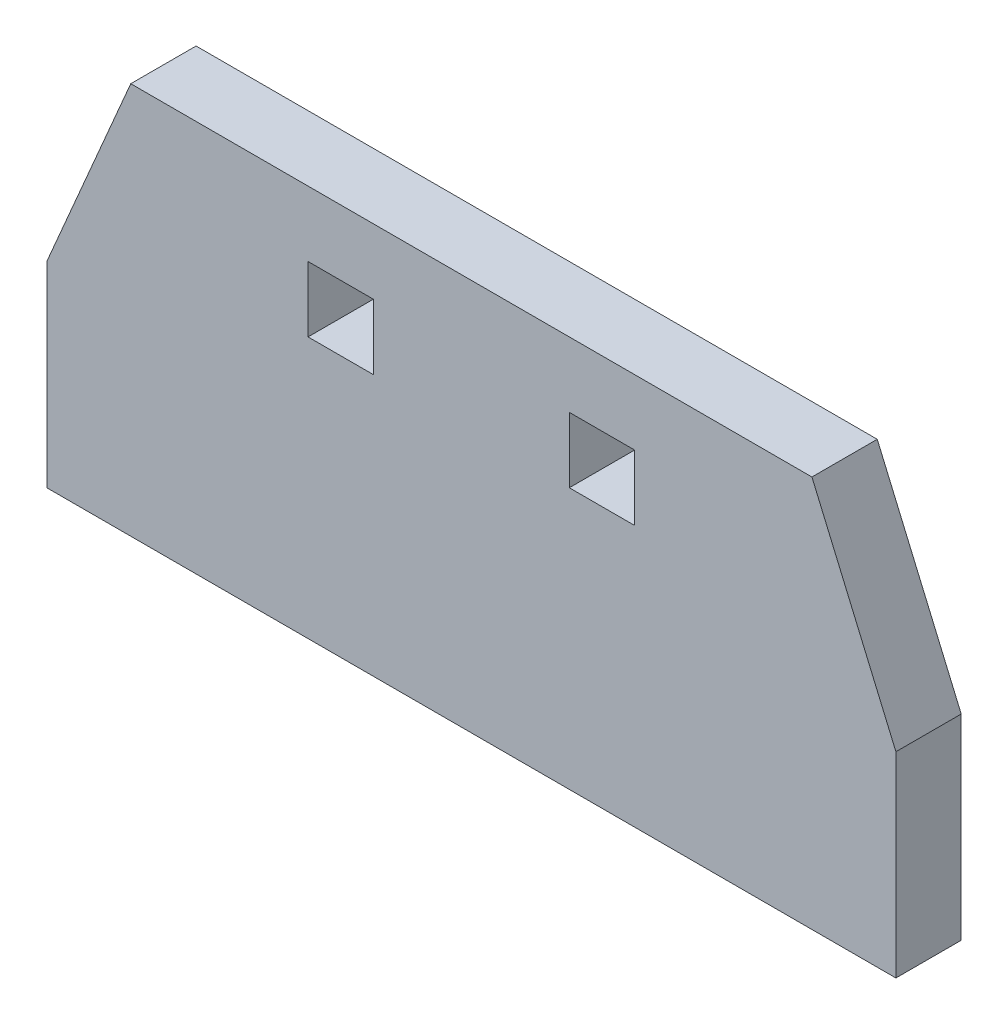
ISO-10303-21;
HEADER;
FILE_DESCRIPTION(('STEP AP214'),'2;1');
FILE_NAME('part.step','',(''),(''),'','','');
FILE_SCHEMA(('AUTOMOTIVE_DESIGN { 1 0 10303 214 1 1 1 1 }'));
ENDSEC;
DATA;
#1=APPLICATION_CONTEXT('core data for automotive mechanical design processes');
#2=APPLICATION_PROTOCOL_DEFINITION('international standard','automotive_design',2000,#1);
#3=PRODUCT_CONTEXT('',#1,'mechanical');
#4=PRODUCT('Part','Part','',(#3));
#5=PRODUCT_RELATED_PRODUCT_CATEGORY('part','',(#4));
#6=PRODUCT_DEFINITION_FORMATION('','',#4);
#7=PRODUCT_DEFINITION_CONTEXT('part definition',#1,'design');
#8=PRODUCT_DEFINITION('design','',#6,#7);
#9=PRODUCT_DEFINITION_SHAPE('','',#8);
#10=(LENGTH_UNIT() NAMED_UNIT(*) SI_UNIT(.MILLI.,.METRE.));
#11=(NAMED_UNIT(*) PLANE_ANGLE_UNIT() SI_UNIT($,.RADIAN.));
#12=(NAMED_UNIT(*) SI_UNIT($,.STERADIAN.) SOLID_ANGLE_UNIT());
#13=UNCERTAINTY_MEASURE_WITH_UNIT(LENGTH_MEASURE(1.E-05),#10,'distance_accuracy_value','');
#14=(GEOMETRIC_REPRESENTATION_CONTEXT(3) GLOBAL_UNCERTAINTY_ASSIGNED_CONTEXT((#13)) GLOBAL_UNIT_ASSIGNED_CONTEXT((#10,
#11,#12)) REPRESENTATION_CONTEXT('',''));
#15=CARTESIAN_POINT('',(0.,0.,0.));
#16=DIRECTION('',(0.,0.,1.));
#17=DIRECTION('',(1.,0.,0.));
#18=AXIS2_PLACEMENT_3D('',#15,#16,#17);
#19=CARTESIAN_POINT('',(0.,0.,0.));
#20=DIRECTION('',(0.,0.,-1.));
#21=DIRECTION('',(-1.,0.,0.));
#22=AXIS2_PLACEMENT_3D('',#19,#20,#21);
#23=PLANE('',#22);
#24=DIRECTION('',(0.,-1.,0.));
#25=VECTOR('',#24,1.);
#26=CARTESIAN_POINT('',(25.,35.,0.));
#27=LINE('',#26,#25);
#28=CARTESIAN_POINT('',(25.,35.,0.));
#29=VERTEX_POINT('',#28);
#30=CARTESIAN_POINT('',(25.,30.,0.));
#31=VERTEX_POINT('',#30);
#32=EDGE_CURVE('E208',#29,#31,#27,.T.);
#33=ORIENTED_EDGE('',*,*,#32,.F.);
#34=DIRECTION('',(1.,0.,0.));
#35=VECTOR('',#34,1.);
#36=CARTESIAN_POINT('',(25.,35.,0.));
#37=LINE('',#36,#35);
#38=CARTESIAN_POINT('',(20.,35.,0.));
#39=VERTEX_POINT('',#38);
#40=EDGE_CURVE('E218',#39,#29,#37,.T.);
#41=ORIENTED_EDGE('',*,*,#40,.F.);
#42=DIRECTION('',(0.,1.,0.));
#43=VECTOR('',#42,1.);
#44=CARTESIAN_POINT('',(20.,35.,0.));
#45=LINE('',#44,#43);
#46=CARTESIAN_POINT('',(20.,30.,0.));
#47=VERTEX_POINT('',#46);
#48=EDGE_CURVE('E232',#47,#39,#45,.T.);
#49=ORIENTED_EDGE('',*,*,#48,.F.);
#50=DIRECTION('',(-1.,0.,0.));
#51=VECTOR('',#50,1.);
#52=CARTESIAN_POINT('',(25.,30.,0.));
#53=LINE('',#52,#51);
#54=EDGE_CURVE('E229',#31,#47,#53,.T.);
#55=ORIENTED_EDGE('',*,*,#54,.F.);
#56=EDGE_LOOP('',(#33,#41,#49,#55));
#57=FACE_BOUND('',#56,.T.);
#58=DIRECTION('',(0.,-1.,0.));
#59=VECTOR('',#58,1.);
#60=CARTESIAN_POINT('',(5.00000000000001,35.,0.));
#61=LINE('',#60,#59);
#62=CARTESIAN_POINT('',(5.00000000000001,35.,0.));
#63=VERTEX_POINT('',#62);
#64=CARTESIAN_POINT('',(5.00000000000001,30.,0.));
#65=VERTEX_POINT('',#64);
#66=EDGE_CURVE('E56',#63,#65,#61,.T.);
#67=ORIENTED_EDGE('',*,*,#66,.F.);
#68=DIRECTION('',(1.,0.,0.));
#69=VECTOR('',#68,1.);
#70=CARTESIAN_POINT('',(5.00000000000001,35.,0.));
#71=LINE('',#70,#69);
#72=CARTESIAN_POINT('',(0.,35.,0.));
#73=VERTEX_POINT('',#72);
#74=EDGE_CURVE('E187',#73,#63,#71,.T.);
#75=ORIENTED_EDGE('',*,*,#74,.F.);
#76=DIRECTION('',(0.,1.,0.));
#77=VECTOR('',#76,1.);
#78=CARTESIAN_POINT('',(0.,35.,0.));
#79=LINE('',#78,#77);
#80=CARTESIAN_POINT('',(0.,30.,0.));
#81=VERTEX_POINT('',#80);
#82=EDGE_CURVE('E201',#81,#73,#79,.T.);
#83=ORIENTED_EDGE('',*,*,#82,.F.);
#84=DIRECTION('',(-1.,0.,0.));
#85=VECTOR('',#84,1.);
#86=CARTESIAN_POINT('',(5.00000000000001,30.,0.));
#87=LINE('',#86,#85);
#88=EDGE_CURVE('E198',#65,#81,#87,.T.);
#89=ORIENTED_EDGE('',*,*,#88,.F.);
#90=EDGE_LOOP('',(#67,#75,#83,#89));
#91=FACE_BOUND('',#90,.T.);
#92=DIRECTION('',(-0.393919298579167,-0.919145030018058,0.));
#93=VECTOR('',#92,1.);
#94=CARTESIAN_POINT('',(-5.00000000000002,60.,0.));
#95=LINE('',#94,#93);
#96=CARTESIAN_POINT('',(-13.5714285714286,40.,0.));
#97=VERTEX_POINT('',#96);
#98=CARTESIAN_POINT('',(-20.,25.,0.));
#99=VERTEX_POINT('',#98);
#100=EDGE_CURVE('E148',#97,#99,#95,.T.);
#101=ORIENTED_EDGE('',*,*,#100,.F.);
#102=DIRECTION('',(1.,0.,0.));
#103=VECTOR('',#102,1.);
#104=CARTESIAN_POINT('',(45.,40.,0.));
#105=LINE('',#104,#103);
#106=CARTESIAN_POINT('',(38.5714285714286,40.,0.));
#107=VERTEX_POINT('',#106);
#108=EDGE_CURVE('E49',#97,#107,#105,.T.);
#109=ORIENTED_EDGE('',*,*,#108,.T.);
#110=DIRECTION('',(-0.393919298579168,0.919145030018058,0.));
#111=VECTOR('',#110,1.);
#112=CARTESIAN_POINT('',(30.,60.,0.));
#113=LINE('',#112,#111);
#114=CARTESIAN_POINT('',(45.,25.,0.));
#115=VERTEX_POINT('',#114);
#116=EDGE_CURVE('E145',#115,#107,#113,.T.);
#117=ORIENTED_EDGE('',*,*,#116,.F.);
#118=DIRECTION('',(0.,1.,0.));
#119=VECTOR('',#118,1.);
#120=CARTESIAN_POINT('',(45.,10.,0.));
#121=LINE('',#120,#119);
#122=CARTESIAN_POINT('',(45.,10.,0.));
#123=VERTEX_POINT('',#122);
#124=EDGE_CURVE('E181',#123,#115,#121,.T.);
#125=ORIENTED_EDGE('',*,*,#124,.F.);
#126=DIRECTION('',(1.,0.,0.));
#127=VECTOR('',#126,1.);
#128=CARTESIAN_POINT('',(37.5,10.,0.));
#129=LINE('',#128,#127);
#130=CARTESIAN_POINT('',(-20.,10.,0.));
#131=VERTEX_POINT('',#130);
#132=EDGE_CURVE('E161',#131,#123,#129,.T.);
#133=ORIENTED_EDGE('',*,*,#132,.F.);
#134=DIRECTION('',(0.,1.,0.));
#135=VECTOR('',#134,1.);
#136=CARTESIAN_POINT('',(-20.,10.,0.));
#137=LINE('',#136,#135);
#138=EDGE_CURVE('E170',#131,#99,#137,.T.);
#139=ORIENTED_EDGE('',*,*,#138,.T.);
#140=EDGE_LOOP('',(#101,#109,#117,#125,#133,#139));
#141=FACE_BOUND('',#140,.T.);
#142=ADVANCED_FACE('F35',(#57,#91,#141),#23,.T.);
#143=CARTESIAN_POINT('',(0.,0.,5.));
#144=DIRECTION('',(0.,0.,1.));
#145=DIRECTION('',(1.,0.,0.));
#146=AXIS2_PLACEMENT_3D('',#143,#144,#145);
#147=PLANE('',#146);
#148=DIRECTION('',(0.,-1.,0.));
#149=VECTOR('',#148,1.);
#150=CARTESIAN_POINT('',(25.,35.,5.));
#151=LINE('',#150,#149);
#152=CARTESIAN_POINT('',(25.,35.,5.));
#153=VERTEX_POINT('',#152);
#154=CARTESIAN_POINT('',(25.,30.,5.));
#155=VERTEX_POINT('',#154);
#156=EDGE_CURVE('E214',#153,#155,#151,.T.);
#157=ORIENTED_EDGE('',*,*,#156,.T.);
#158=DIRECTION('',(-1.,0.,0.));
#159=VECTOR('',#158,1.);
#160=CARTESIAN_POINT('',(25.,30.,5.));
#161=LINE('',#160,#159);
#162=CARTESIAN_POINT('',(20.,30.,5.));
#163=VERTEX_POINT('',#162);
#164=EDGE_CURVE('E217',#155,#163,#161,.T.);
#165=ORIENTED_EDGE('',*,*,#164,.T.);
#166=DIRECTION('',(0.,1.,0.));
#167=VECTOR('',#166,1.);
#168=CARTESIAN_POINT('',(20.,35.,5.));
#169=LINE('',#168,#167);
#170=CARTESIAN_POINT('',(20.,35.,5.));
#171=VERTEX_POINT('',#170);
#172=EDGE_CURVE('E221',#163,#171,#169,.T.);
#173=ORIENTED_EDGE('',*,*,#172,.T.);
#174=DIRECTION('',(1.,0.,0.));
#175=VECTOR('',#174,1.);
#176=CARTESIAN_POINT('',(25.,35.,5.));
#177=LINE('',#176,#175);
#178=EDGE_CURVE('E224',#171,#153,#177,.T.);
#179=ORIENTED_EDGE('',*,*,#178,.T.);
#180=EDGE_LOOP('',(#157,#165,#173,#179));
#181=FACE_BOUND('',#180,.T.);
#182=DIRECTION('',(0.,-1.,0.));
#183=VECTOR('',#182,1.);
#184=CARTESIAN_POINT('',(5.00000000000001,35.,5.));
#185=LINE('',#184,#183);
#186=CARTESIAN_POINT('',(5.00000000000001,35.,5.));
#187=VERTEX_POINT('',#186);
#188=CARTESIAN_POINT('',(5.00000000000001,30.,5.));
#189=VERTEX_POINT('',#188);
#190=EDGE_CURVE('E183',#187,#189,#185,.T.);
#191=ORIENTED_EDGE('',*,*,#190,.T.);
#192=DIRECTION('',(-1.,0.,0.));
#193=VECTOR('',#192,1.);
#194=CARTESIAN_POINT('',(5.00000000000001,30.,5.));
#195=LINE('',#194,#193);
#196=CARTESIAN_POINT('',(0.,30.,5.));
#197=VERTEX_POINT('',#196);
#198=EDGE_CURVE('E186',#189,#197,#195,.T.);
#199=ORIENTED_EDGE('',*,*,#198,.T.);
#200=DIRECTION('',(0.,1.,0.));
#201=VECTOR('',#200,1.);
#202=CARTESIAN_POINT('',(0.,35.,5.));
#203=LINE('',#202,#201);
#204=CARTESIAN_POINT('',(0.,35.,5.));
#205=VERTEX_POINT('',#204);
#206=EDGE_CURVE('E190',#197,#205,#203,.T.);
#207=ORIENTED_EDGE('',*,*,#206,.T.);
#208=DIRECTION('',(1.,0.,0.));
#209=VECTOR('',#208,1.);
#210=CARTESIAN_POINT('',(5.00000000000001,35.,5.));
#211=LINE('',#210,#209);
#212=EDGE_CURVE('E193',#205,#187,#211,.T.);
#213=ORIENTED_EDGE('',*,*,#212,.T.);
#214=EDGE_LOOP('',(#191,#199,#207,#213));
#215=FACE_BOUND('',#214,.T.);
#216=DIRECTION('',(-0.393919298579168,0.919145030018058,0.));
#217=VECTOR('',#216,1.);
#218=CARTESIAN_POINT('',(30.,60.,5.));
#219=LINE('',#218,#217);
#220=CARTESIAN_POINT('',(45.,25.,5.00000000000001));
#221=VERTEX_POINT('',#220);
#222=CARTESIAN_POINT('',(38.5714285714286,40.,5.00000000000001));
#223=VERTEX_POINT('',#222);
#224=EDGE_CURVE('E153',#221,#223,#219,.T.);
#225=ORIENTED_EDGE('',*,*,#224,.T.);
#226=DIRECTION('',(-1.,0.,0.));
#227=VECTOR('',#226,1.);
#228=CARTESIAN_POINT('',(-20.,40.,5.));
#229=LINE('',#228,#227);
#230=CARTESIAN_POINT('',(-13.5714285714286,40.,5.));
#231=VERTEX_POINT('',#230);
#232=EDGE_CURVE('E135',#223,#231,#229,.T.);
#233=ORIENTED_EDGE('',*,*,#232,.T.);
#234=DIRECTION('',(-0.393919298579167,-0.919145030018058,0.));
#235=VECTOR('',#234,1.);
#236=CARTESIAN_POINT('',(-5.00000000000002,60.,5.));
#237=LINE('',#236,#235);
#238=CARTESIAN_POINT('',(-20.,25.,5.));
#239=VERTEX_POINT('',#238);
#240=EDGE_CURVE('E139',#231,#239,#237,.T.);
#241=ORIENTED_EDGE('',*,*,#240,.T.);
#242=DIRECTION('',(0.,1.,0.));
#243=VECTOR('',#242,1.);
#244=CARTESIAN_POINT('',(-20.,10.,5.));
#245=LINE('',#244,#243);
#246=CARTESIAN_POINT('',(-20.,10.,5.));
#247=VERTEX_POINT('',#246);
#248=EDGE_CURVE('E175',#247,#239,#245,.T.);
#249=ORIENTED_EDGE('',*,*,#248,.F.);
#250=DIRECTION('',(-1.,0.,0.));
#251=VECTOR('',#250,1.);
#252=CARTESIAN_POINT('',(37.5,10.,5.));
#253=LINE('',#252,#251);
#254=CARTESIAN_POINT('',(45.,10.,5.00000000000001));
#255=VERTEX_POINT('',#254);
#256=EDGE_CURVE('E166',#255,#247,#253,.T.);
#257=ORIENTED_EDGE('',*,*,#256,.F.);
#258=DIRECTION('',(0.,1.,0.));
#259=VECTOR('',#258,1.);
#260=CARTESIAN_POINT('',(45.,10.,5.00000000000001));
#261=LINE('',#260,#259);
#262=EDGE_CURVE('E178',#255,#221,#261,.T.);
#263=ORIENTED_EDGE('',*,*,#262,.T.);
#264=EDGE_LOOP('',(#225,#233,#241,#249,#257,#263));
#265=FACE_BOUND('',#264,.T.);
#266=ADVANCED_FACE('F258',(#181,#215,#265),#147,.T.);
#267=CARTESIAN_POINT('',(30.,60.,0.));
#268=DIRECTION('',(0.919145030018058,0.393919298579168,0.));
#269=DIRECTION('',(-0.393919298579168,0.919145030018058,0.));
#270=AXIS2_PLACEMENT_3D('',#267,#268,#269);
#271=PLANE('',#270);
#272=ORIENTED_EDGE('',*,*,#116,.T.);
#273=DIRECTION('',(0.,0.,1.));
#274=VECTOR('',#273,1.);
#275=CARTESIAN_POINT('',(38.5714285714286,40.,0.));
#276=LINE('',#275,#274);
#277=EDGE_CURVE('E132',#107,#223,#276,.T.);
#278=ORIENTED_EDGE('',*,*,#277,.T.);
#279=ORIENTED_EDGE('',*,*,#224,.F.);
#280=DIRECTION('',(0.,0.,1.));
#281=VECTOR('',#280,1.);
#282=CARTESIAN_POINT('',(45.,25.,5.00000000000001));
#283=LINE('',#282,#281);
#284=EDGE_CURVE('E152',#115,#221,#283,.T.);
#285=ORIENTED_EDGE('',*,*,#284,.F.);
#286=EDGE_LOOP('',(#272,#278,#279,#285));
#287=FACE_BOUND('',#286,.T.);
#288=ADVANCED_FACE('F150',(#287),#271,.T.);
#289=CARTESIAN_POINT('',(-5.00000000000002,60.,0.));
#290=DIRECTION('',(-0.919145030018058,0.393919298579167,0.));
#291=DIRECTION('',(-0.393919298579167,-0.919145030018058,0.));
#292=AXIS2_PLACEMENT_3D('',#289,#290,#291);
#293=PLANE('',#292);
#294=ORIENTED_EDGE('',*,*,#240,.F.);
#295=DIRECTION('',(0.,0.,-1.));
#296=VECTOR('',#295,1.);
#297=CARTESIAN_POINT('',(-13.5714285714286,40.,0.));
#298=LINE('',#297,#296);
#299=EDGE_CURVE('E12',#231,#97,#298,.T.);
#300=ORIENTED_EDGE('',*,*,#299,.T.);
#301=ORIENTED_EDGE('',*,*,#100,.T.);
#302=DIRECTION('',(0.,0.,-1.));
#303=VECTOR('',#302,1.);
#304=CARTESIAN_POINT('',(-20.,25.,5.));
#305=LINE('',#304,#303);
#306=EDGE_CURVE('E155',#239,#99,#305,.T.);
#307=ORIENTED_EDGE('',*,*,#306,.F.);
#308=EDGE_LOOP('',(#294,#300,#301,#307));
#309=FACE_BOUND('',#308,.T.);
#310=ADVANCED_FACE('F270',(#309),#293,.T.);
#311=CARTESIAN_POINT('',(25.,35.,5.));
#312=DIRECTION('',(1.,0.,0.));
#313=DIRECTION('',(0.,0.,-1.));
#314=AXIS2_PLACEMENT_3D('',#311,#312,#313);
#315=PLANE('',#314);
#316=ORIENTED_EDGE('',*,*,#32,.T.);
#317=DIRECTION('',(0.,0.,-1.));
#318=VECTOR('',#317,1.);
#319=CARTESIAN_POINT('',(25.,30.,5.));
#320=LINE('',#319,#318);
#321=EDGE_CURVE('E227',#155,#31,#320,.T.);
#322=ORIENTED_EDGE('',*,*,#321,.F.);
#323=ORIENTED_EDGE('',*,*,#156,.F.);
#324=DIRECTION('',(0.,0.,-1.));
#325=VECTOR('',#324,1.);
#326=CARTESIAN_POINT('',(25.,35.,5.));
#327=LINE('',#326,#325);
#328=EDGE_CURVE('E42',#153,#29,#327,.T.);
#329=ORIENTED_EDGE('',*,*,#328,.T.);
#330=EDGE_LOOP('',(#316,#322,#323,#329));
#331=FACE_BOUND('',#330,.T.);
#332=ADVANCED_FACE('F260',(#331),#315,.F.);
#333=CARTESIAN_POINT('',(25.,35.,5.));
#334=DIRECTION('',(0.,1.,0.));
#335=DIRECTION('',(0.,0.,1.));
#336=AXIS2_PLACEMENT_3D('',#333,#334,#335);
#337=PLANE('',#336);
#338=ORIENTED_EDGE('',*,*,#40,.T.);
#339=ORIENTED_EDGE('',*,*,#328,.F.);
#340=ORIENTED_EDGE('',*,*,#178,.F.);
#341=DIRECTION('',(0.,0.,-1.));
#342=VECTOR('',#341,1.);
#343=CARTESIAN_POINT('',(20.,35.,5.));
#344=LINE('',#343,#342);
#345=EDGE_CURVE('E238',#171,#39,#344,.T.);
#346=ORIENTED_EDGE('',*,*,#345,.T.);
#347=EDGE_LOOP('',(#338,#339,#340,#346));
#348=FACE_BOUND('',#347,.T.);
#349=ADVANCED_FACE('F262',(#348),#337,.F.);
#350=CARTESIAN_POINT('',(20.,35.,5.));
#351=DIRECTION('',(-1.,0.,0.));
#352=DIRECTION('',(0.,0.,1.));
#353=AXIS2_PLACEMENT_3D('',#350,#351,#352);
#354=PLANE('',#353);
#355=ORIENTED_EDGE('',*,*,#48,.T.);
#356=ORIENTED_EDGE('',*,*,#345,.F.);
#357=ORIENTED_EDGE('',*,*,#172,.F.);
#358=DIRECTION('',(0.,0.,-1.));
#359=VECTOR('',#358,1.);
#360=CARTESIAN_POINT('',(20.,30.,5.));
#361=LINE('',#360,#359);
#362=EDGE_CURVE('E240',#163,#47,#361,.T.);
#363=ORIENTED_EDGE('',*,*,#362,.T.);
#364=EDGE_LOOP('',(#355,#356,#357,#363));
#365=FACE_BOUND('',#364,.T.);
#366=ADVANCED_FACE('F255',(#365),#354,.F.);
#367=CARTESIAN_POINT('',(25.,30.,5.));
#368=DIRECTION('',(0.,-1.,0.));
#369=DIRECTION('',(0.,0.,-1.));
#370=AXIS2_PLACEMENT_3D('',#367,#368,#369);
#371=PLANE('',#370);
#372=ORIENTED_EDGE('',*,*,#54,.T.);
#373=ORIENTED_EDGE('',*,*,#362,.F.);
#374=ORIENTED_EDGE('',*,*,#164,.F.);
#375=ORIENTED_EDGE('',*,*,#321,.T.);
#376=EDGE_LOOP('',(#372,#373,#374,#375));
#377=FACE_BOUND('',#376,.T.);
#378=ADVANCED_FACE('F245',(#377),#371,.F.);
#379=CARTESIAN_POINT('',(5.00000000000001,35.,5.));
#380=DIRECTION('',(1.,0.,0.));
#381=DIRECTION('',(0.,0.,-1.));
#382=AXIS2_PLACEMENT_3D('',#379,#380,#381);
#383=PLANE('',#382);
#384=ORIENTED_EDGE('',*,*,#66,.T.);
#385=DIRECTION('',(0.,0.,-1.));
#386=VECTOR('',#385,1.);
#387=CARTESIAN_POINT('',(5.00000000000001,30.,5.));
#388=LINE('',#387,#386);
#389=EDGE_CURVE('E196',#189,#65,#388,.T.);
#390=ORIENTED_EDGE('',*,*,#389,.F.);
#391=ORIENTED_EDGE('',*,*,#190,.F.);
#392=DIRECTION('',(0.,0.,-1.));
#393=VECTOR('',#392,1.);
#394=CARTESIAN_POINT('',(5.00000000000001,35.,5.));
#395=LINE('',#394,#393);
#396=EDGE_CURVE('E206',#187,#63,#395,.T.);
#397=ORIENTED_EDGE('',*,*,#396,.T.);
#398=EDGE_LOOP('',(#384,#390,#391,#397));
#399=FACE_BOUND('',#398,.T.);
#400=ADVANCED_FACE('F284',(#399),#383,.F.);
#401=CARTESIAN_POINT('',(5.00000000000001,35.,5.));
#402=DIRECTION('',(0.,1.,0.));
#403=DIRECTION('',(0.,0.,1.));
#404=AXIS2_PLACEMENT_3D('',#401,#402,#403);
#405=PLANE('',#404);
#406=ORIENTED_EDGE('',*,*,#74,.T.);
#407=ORIENTED_EDGE('',*,*,#396,.F.);
#408=ORIENTED_EDGE('',*,*,#212,.F.);
#409=DIRECTION('',(0.,0.,-1.));
#410=VECTOR('',#409,1.);
#411=CARTESIAN_POINT('',(0.,35.,5.));
#412=LINE('',#411,#410);
#413=EDGE_CURVE('E209',#205,#73,#412,.T.);
#414=ORIENTED_EDGE('',*,*,#413,.T.);
#415=EDGE_LOOP('',(#406,#407,#408,#414));
#416=FACE_BOUND('',#415,.T.);
#417=ADVANCED_FACE('F288',(#416),#405,.F.);
#418=CARTESIAN_POINT('',(0.,35.,5.));
#419=DIRECTION('',(-1.,0.,0.));
#420=DIRECTION('',(0.,-1.,0.));
#421=AXIS2_PLACEMENT_3D('',#418,#419,#420);
#422=PLANE('',#421);
#423=ORIENTED_EDGE('',*,*,#82,.T.);
#424=ORIENTED_EDGE('',*,*,#413,.F.);
#425=ORIENTED_EDGE('',*,*,#206,.F.);
#426=DIRECTION('',(0.,0.,-1.));
#427=VECTOR('',#426,1.);
#428=CARTESIAN_POINT('',(0.,30.,5.));
#429=LINE('',#428,#427);
#430=EDGE_CURVE('E211',#197,#81,#429,.T.);
#431=ORIENTED_EDGE('',*,*,#430,.T.);
#432=EDGE_LOOP('',(#423,#424,#425,#431));
#433=FACE_BOUND('',#432,.T.);
#434=ADVANCED_FACE('F292',(#433),#422,.F.);
#435=CARTESIAN_POINT('',(5.00000000000001,30.,5.));
#436=DIRECTION('',(0.,-1.,0.));
#437=DIRECTION('',(0.,0.,-1.));
#438=AXIS2_PLACEMENT_3D('',#435,#436,#437);
#439=PLANE('',#438);
#440=ORIENTED_EDGE('',*,*,#88,.T.);
#441=ORIENTED_EDGE('',*,*,#430,.F.);
#442=ORIENTED_EDGE('',*,*,#198,.F.);
#443=ORIENTED_EDGE('',*,*,#389,.T.);
#444=EDGE_LOOP('',(#440,#441,#442,#443));
#445=FACE_BOUND('',#444,.T.);
#446=ADVANCED_FACE('F296',(#445),#439,.F.);
#447=CARTESIAN_POINT('',(-20.,10.,5.));
#448=DIRECTION('',(1.,0.,0.));
#449=DIRECTION('',(0.,0.,-1.));
#450=AXIS2_PLACEMENT_3D('',#447,#448,#449);
#451=PLANE('',#450);
#452=ORIENTED_EDGE('',*,*,#306,.T.);
#453=ORIENTED_EDGE('',*,*,#138,.F.);
#454=DIRECTION('',(0.,0.,-1.));
#455=VECTOR('',#454,1.);
#456=CARTESIAN_POINT('',(-20.,10.,5.));
#457=LINE('',#456,#455);
#458=EDGE_CURVE('E168',#247,#131,#457,.T.);
#459=ORIENTED_EDGE('',*,*,#458,.F.);
#460=ORIENTED_EDGE('',*,*,#248,.T.);
#461=EDGE_LOOP('',(#452,#453,#459,#460));
#462=FACE_BOUND('',#461,.T.);
#463=ADVANCED_FACE('F299',(#462),#451,.F.);
#464=CARTESIAN_POINT('',(0.,10.,0.));
#465=DIRECTION('',(0.,1.,0.));
#466=DIRECTION('',(0.,0.,1.));
#467=AXIS2_PLACEMENT_3D('',#464,#465,#466);
#468=PLANE('',#467);
#469=ORIENTED_EDGE('',*,*,#132,.T.);
#470=DIRECTION('',(0.,0.,1.));
#471=VECTOR('',#470,1.);
#472=CARTESIAN_POINT('',(45.,10.,5.00000000000001));
#473=LINE('',#472,#471);
#474=EDGE_CURVE('E164',#123,#255,#473,.T.);
#475=ORIENTED_EDGE('',*,*,#474,.T.);
#476=ORIENTED_EDGE('',*,*,#256,.T.);
#477=ORIENTED_EDGE('',*,*,#458,.T.);
#478=EDGE_LOOP('',(#469,#475,#476,#477));
#479=FACE_BOUND('',#478,.T.);
#480=ADVANCED_FACE('F306',(#479),#468,.F.);
#481=CARTESIAN_POINT('',(45.,10.,5.00000000000001));
#482=DIRECTION('',(-1.,0.,0.));
#483=DIRECTION('',(0.,0.,1.));
#484=AXIS2_PLACEMENT_3D('',#481,#482,#483);
#485=PLANE('',#484);
#486=ORIENTED_EDGE('',*,*,#284,.T.);
#487=ORIENTED_EDGE('',*,*,#262,.F.);
#488=ORIENTED_EDGE('',*,*,#474,.F.);
#489=ORIENTED_EDGE('',*,*,#124,.T.);
#490=EDGE_LOOP('',(#486,#487,#488,#489));
#491=FACE_BOUND('',#490,.T.);
#492=ADVANCED_FACE('F304',(#491),#485,.F.);
#493=CARTESIAN_POINT('',(25.,40.,5.));
#494=DIRECTION('',(0.,1.,0.));
#495=DIRECTION('',(0.,0.,1.));
#496=AXIS2_PLACEMENT_3D('',#493,#494,#495);
#497=PLANE('',#496);
#498=ORIENTED_EDGE('',*,*,#108,.F.);
#499=ORIENTED_EDGE('',*,*,#299,.F.);
#500=ORIENTED_EDGE('',*,*,#232,.F.);
#501=ORIENTED_EDGE('',*,*,#277,.F.);
#502=EDGE_LOOP('',(#498,#499,#500,#501));
#503=FACE_BOUND('',#502,.T.);
#504=ADVANCED_FACE('F133',(#503),#497,.T.);
#505=CLOSED_SHELL('',(#142,#266,#288,#310,#332,#349,#366,#378,#400,#417,#434,#446,#463,#480,
#492,#504));
#506=MANIFOLD_SOLID_BREP('B2',#505);
#507=ADVANCED_BREP_SHAPE_REPRESENTATION('',(#18,#506),#14);
#508=SHAPE_DEFINITION_REPRESENTATION(#9,#507);
ENDSEC;
END-ISO-10303-21;
